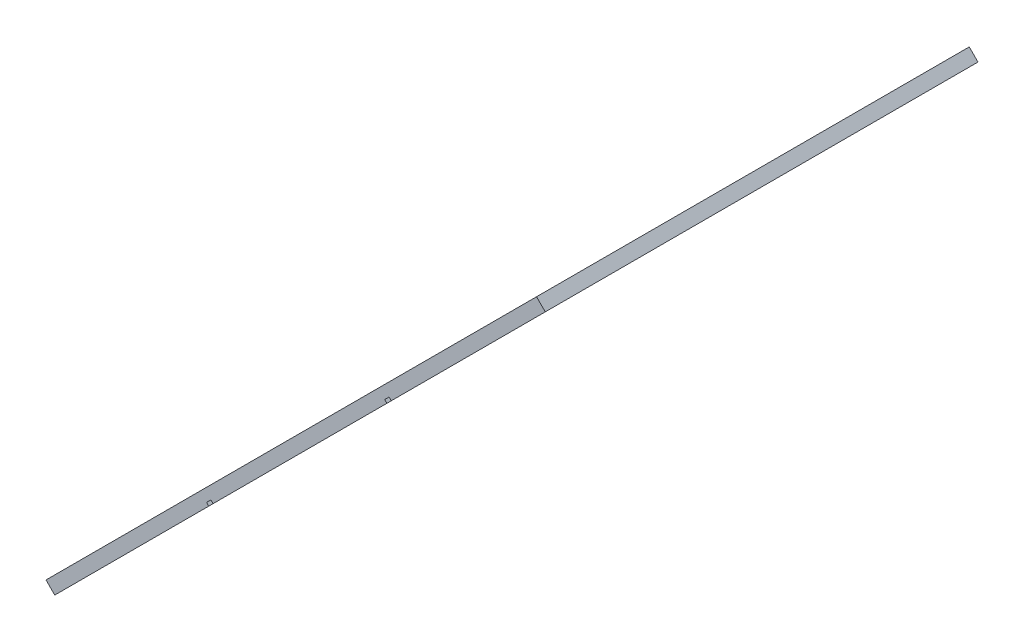
ISO-10303-21;
HEADER;
FILE_DESCRIPTION(('STEP AP214'),'2;1');
FILE_NAME('part.step','',(''),(''),'','','');
FILE_SCHEMA(('AUTOMOTIVE_DESIGN { 1 0 10303 214 1 1 1 1 }'));
ENDSEC;
DATA;
#1=APPLICATION_CONTEXT('core data for automotive mechanical design processes');
#2=APPLICATION_PROTOCOL_DEFINITION('international standard','automotive_design',2000,#1);
#3=PRODUCT_CONTEXT('',#1,'mechanical');
#4=PRODUCT('Part','Part','',(#3));
#5=PRODUCT_RELATED_PRODUCT_CATEGORY('part','',(#4));
#6=PRODUCT_DEFINITION_FORMATION('','',#4);
#7=PRODUCT_DEFINITION_CONTEXT('part definition',#1,'design');
#8=PRODUCT_DEFINITION('design','',#6,#7);
#9=PRODUCT_DEFINITION_SHAPE('','',#8);
#10=(LENGTH_UNIT() NAMED_UNIT(*) SI_UNIT(.MILLI.,.METRE.));
#11=(NAMED_UNIT(*) PLANE_ANGLE_UNIT() SI_UNIT($,.RADIAN.));
#12=(NAMED_UNIT(*) SI_UNIT($,.STERADIAN.) SOLID_ANGLE_UNIT());
#13=UNCERTAINTY_MEASURE_WITH_UNIT(LENGTH_MEASURE(1.E-05),#10,'distance_accuracy_value','');
#14=(GEOMETRIC_REPRESENTATION_CONTEXT(3) GLOBAL_UNCERTAINTY_ASSIGNED_CONTEXT((#13)) GLOBAL_UNIT_ASSIGNED_CONTEXT((#10,
#11,#12)) REPRESENTATION_CONTEXT('',''));
#15=CARTESIAN_POINT('',(0.,0.,0.));
#16=DIRECTION('',(0.,0.,1.));
#17=DIRECTION('',(1.,0.,0.));
#18=AXIS2_PLACEMENT_3D('',#15,#16,#17);
#19=CARTESIAN_POINT('',(-184.319805153395,151.035533905932,50.));
#20=DIRECTION('',(0.707106781186549,-0.707106781186546,0.));
#21=DIRECTION('',(0.707106781186546,0.707106781186549,0.));
#22=AXIS2_PLACEMENT_3D('',#19,#20,#21);
#23=PLANE('',#22);
#24=DIRECTION('',(0.,0.,1.));
#25=VECTOR('',#24,1.);
#26=CARTESIAN_POINT('',(-155.415506253417,179.93983280591,49.9999999999997));
#27=LINE('',#26,#25);
#28=CARTESIAN_POINT('',(-155.415506253417,179.93983280591,49.9999999999997));
#29=VERTEX_POINT('',#28);
#30=CARTESIAN_POINT('',(-155.415506253417,179.93983280591,120.));
#31=VERTEX_POINT('',#30);
#32=EDGE_CURVE('E241',#29,#31,#27,.T.);
#33=ORIENTED_EDGE('',*,*,#32,.F.);
#34=DIRECTION('',(0.707106781186546,0.707106781186549,0.));
#35=VECTOR('',#34,1.);
#36=CARTESIAN_POINT('',(-184.319805153395,151.035533905932,50.));
#37=LINE('',#36,#35);
#38=CARTESIAN_POINT('',(-130.502585382088,204.852753677239,50.));
#39=VERTEX_POINT('',#38);
#40=EDGE_CURVE('E361',#29,#39,#37,.T.);
#41=ORIENTED_EDGE('',*,*,#40,.T.);
#42=DIRECTION('',(0.,0.,-1.));
#43=VECTOR('',#42,1.);
#44=CARTESIAN_POINT('',(-130.502585382088,204.852753677239,50.));
#45=LINE('',#44,#43);
#46=CARTESIAN_POINT('',(-130.502585382088,204.852753677239,120.));
#47=VERTEX_POINT('',#46);
#48=EDGE_CURVE('E278',#39,#47,#45,.F.);
#49=ORIENTED_EDGE('',*,*,#48,.T.);
#50=DIRECTION('',(0.707106781186546,0.707106781186549,0.));
#51=VECTOR('',#50,1.);
#52=CARTESIAN_POINT('',(-184.319805153395,151.035533905932,120.));
#53=LINE('',#52,#51);
#54=EDGE_CURVE('E365',#31,#47,#53,.T.);
#55=ORIENTED_EDGE('',*,*,#54,.F.);
#56=EDGE_LOOP('',(#33,#41,#49,#55));
#57=FACE_BOUND('',#56,.T.);
#58=ADVANCED_FACE('F41',(#57),#23,.T.);
#59=DIRECTION('',(0.,0.,-1.));
#60=VECTOR('',#59,1.);
#61=CARTESIAN_POINT('',(-156.122613034604,179.232726024723,49.9999999999997));
#62=LINE('',#61,#60);
#63=CARTESIAN_POINT('',(-156.122613034604,179.232726024724,120.));
#64=VERTEX_POINT('',#63);
#65=CARTESIAN_POINT('',(-156.122613034604,179.232726024723,49.9999999999997));
#66=VERTEX_POINT('',#65);
#67=EDGE_CURVE('E271',#64,#66,#62,.T.);
#68=ORIENTED_EDGE('',*,*,#67,.F.);
#69=CARTESIAN_POINT('',(-184.232726024724,151.122613034603,120.));
#70=VERTEX_POINT('',#69);
#71=EDGE_CURVE('E247',#70,#64,#53,.T.);
#72=ORIENTED_EDGE('',*,*,#71,.F.);
#73=DIRECTION('',(0.,0.,1.));
#74=VECTOR('',#73,1.);
#75=CARTESIAN_POINT('',(-184.232726024724,151.122613034603,50.0000000000001));
#76=LINE('',#75,#74);
#77=CARTESIAN_POINT('',(-184.232726024724,151.122613034603,50.0000000000001));
#78=VERTEX_POINT('',#77);
#79=EDGE_CURVE('E258',#78,#70,#76,.T.);
#80=ORIENTED_EDGE('',*,*,#79,.F.);
#81=EDGE_CURVE('E360',#78,#66,#37,.T.);
#82=ORIENTED_EDGE('',*,*,#81,.T.);
#83=EDGE_LOOP('',(#68,#72,#80,#82));
#84=FACE_BOUND('',#83,.T.);
#85=CARTESIAN_POINT('',(-175.186205619217,160.16913344011,104.298625785396));
#86=DIRECTION('',(-0.707106781186549,0.707106781186546,0.));
#87=DIRECTION('',(-0.707106781186546,-0.707106781186549,0.));
#88=AXIS2_PLACEMENT_3D('',#85,#86,#87);
#89=CIRCLE('',#88,3.);
#90=CARTESIAN_POINT('',(-173.123673896905,162.231665162423,103.597251570793));
#91=VERTEX_POINT('',#90);
#92=CARTESIAN_POINT('',(-173.372296946362,161.983042112965,105.85409055616));
#93=VERTEX_POINT('',#92);
#94=EDGE_CURVE('E295',#91,#93,#89,.F.);
#95=ORIENTED_EDGE('',*,*,#94,.F.);
#96=CARTESIAN_POINT('',(-177.248737341529,158.106601717798,105.));
#97=DIRECTION('',(-0.707106781186549,0.707106781186546,0.));
#98=DIRECTION('',(-0.707106781186546,-0.707106781186549,0.));
#99=AXIS2_PLACEMENT_3D('',#96,#97,#98);
#100=CIRCLE('',#99,6.00000000000001);
#101=CARTESIAN_POINT('',(-181.00151777502,154.353821284307,102.201200608114));
#102=VERTEX_POINT('',#101);
#103=EDGE_CURVE('E369',#91,#102,#100,.T.);
#104=ORIENTED_EDGE('',*,*,#103,.T.);
#105=CARTESIAN_POINT('',(-179.125127558275,156.230211501053,103.600600304057));
#106=DIRECTION('',(-0.707106781186549,0.707106781186546,0.));
#107=DIRECTION('',(-0.707106781186546,-0.707106781186549,0.));
#108=AXIS2_PLACEMENT_3D('',#105,#106,#107);
#109=CIRCLE('',#108,3.);
#110=CARTESIAN_POINT('',(-181.245777931757,154.10956112757,103.525208083656));
#111=VERTEX_POINT('',#110);
#112=EDGE_CURVE('E373',#102,#111,#109,.T.);
#113=ORIENTED_EDGE('',*,*,#112,.T.);
#114=DIRECTION('',(-0.0177701167648365,-0.0177701167648367,0.999684173076841));
#115=VECTOR('',#114,1.);
#116=CARTESIAN_POINT('',(-179.39813491411,155.957204145217,-0.416679675499514));
#117=LINE('',#116,#115);
#118=CARTESIAN_POINT('',(-181.378046154952,153.977292904375,110.966152399246));
#119=VERTEX_POINT('',#118);
#120=EDGE_CURVE('E376',#111,#119,#117,.T.);
#121=ORIENTED_EDGE('',*,*,#120,.T.);
#122=CARTESIAN_POINT('',(-179.257395781469,156.097943277858,111.041544619647));
#123=DIRECTION('',(-0.707106781186549,0.707106781186546,0.));
#124=DIRECTION('',(-0.707106781186546,-0.707106781186549,0.));
#125=AXIS2_PLACEMENT_3D('',#122,#123,#124);
#126=CIRCLE('',#125,3.00000000000001);
#127=CARTESIAN_POINT('',(-181.04073041417,154.314608645157,112.666178478589));
#128=VERTEX_POINT('',#127);
#129=EDGE_CURVE('E379',#128,#119,#126,.F.);
#130=ORIENTED_EDGE('',*,*,#129,.F.);
#131=CARTESIAN_POINT('',(-178.662950903902,156.692388155425,110.5));
#132=DIRECTION('',(-0.707106781186549,0.707106781186546,0.));
#133=DIRECTION('',(-0.707106781186546,-0.707106781186549,0.));
#134=AXIS2_PLACEMENT_3D('',#131,#132,#133);
#135=CIRCLE('',#134,4.00000000000001);
#136=CARTESIAN_POINT('',(-176.488019763067,158.86731929626,113.057215099527));
#137=VERTEX_POINT('',#136);
#138=EDGE_CURVE('E382',#137,#128,#135,.F.);
#139=ORIENTED_EDGE('',*,*,#138,.F.);
#140=CARTESIAN_POINT('',(-178.119218118694,157.236120940634,111.139303774882));
#141=DIRECTION('',(-0.707106781186549,0.707106781186546,0.));
#142=DIRECTION('',(-0.707106781186546,-0.707106781186549,0.));
#143=AXIS2_PLACEMENT_3D('',#140,#141,#142);
#144=CIRCLE('',#143,2.99999999999999);
#145=CARTESIAN_POINT('',(-176.305309445839,159.050029613488,112.694768545645));
#146=VERTEX_POINT('',#145);
#147=EDGE_CURVE('E385',#137,#146,#144,.T.);
#148=ORIENTED_EDGE('',*,*,#147,.T.);
#149=DIRECTION('',(-0.366626562434572,-0.366626562434574,0.855084748685659));
#150=VECTOR('',#149,1.);
#151=CARTESIAN_POINT('',(-138.656493093717,196.698845965611,24.8862681058764));
#152=LINE('',#151,#150);
#153=EDGE_CURVE('E368',#93,#146,#152,.T.);
#154=ORIENTED_EDGE('',*,*,#153,.F.);
#155=EDGE_LOOP('',(#95,#104,#113,#121,#130,#139,#148,#154));
#156=FACE_BOUND('',#155,.T.);
#157=CARTESIAN_POINT('',(-161.230211501053,174.125127558274,103.600600304057));
#158=DIRECTION('',(-0.707106781186549,0.707106781186546,0.));
#159=DIRECTION('',(-0.707106781186546,-0.707106781186549,0.));
#160=AXIS2_PLACEMENT_3D('',#157,#158,#159);
#161=CIRCLE('',#160,3.00000000000001);
#162=CARTESIAN_POINT('',(-159.353821284308,176.00151777502,102.201200608114));
#163=VERTEX_POINT('',#162);
#164=CARTESIAN_POINT('',(-159.10956112757,176.245777931757,103.525208083656));
#165=VERTEX_POINT('',#164);
#166=EDGE_CURVE('E372',#163,#165,#161,.F.);
#167=ORIENTED_EDGE('',*,*,#166,.F.);
#168=CARTESIAN_POINT('',(-163.106601717798,172.248737341529,105.));
#169=DIRECTION('',(-0.707106781186549,0.707106781186546,0.));
#170=DIRECTION('',(-0.707106781186546,-0.707106781186549,0.));
#171=AXIS2_PLACEMENT_3D('',#168,#169,#170);
#172=CIRCLE('',#171,6.00000000000001);
#173=CARTESIAN_POINT('',(-167.231665162423,168.123673896904,103.597251570793));
#174=VERTEX_POINT('',#173);
#175=EDGE_CURVE('E393',#174,#163,#172,.F.);
#176=ORIENTED_EDGE('',*,*,#175,.F.);
#177=CARTESIAN_POINT('',(-165.169133440111,170.186205619217,104.298625785396));
#178=DIRECTION('',(-0.707106781186549,0.707106781186546,0.));
#179=DIRECTION('',(-0.707106781186546,-0.707106781186549,0.));
#180=AXIS2_PLACEMENT_3D('',#177,#178,#179);
#181=CIRCLE('',#180,3.);
#182=CARTESIAN_POINT('',(-166.983042112965,168.372296946362,105.85409055616));
#183=VERTEX_POINT('',#182);
#184=EDGE_CURVE('E396',#174,#183,#181,.T.);
#185=ORIENTED_EDGE('',*,*,#184,.T.);
#186=DIRECTION('',(0.366626562434572,0.366626562434574,0.855084748685659));
#187=VECTOR('',#186,1.);
#188=CARTESIAN_POINT('',(-200.354695602785,135.000643456542,28.0212359258847));
#189=LINE('',#188,#187);
#190=CARTESIAN_POINT('',(-164.050029613489,171.305309445839,112.694768545645));
#191=VERTEX_POINT('',#190);
#192=EDGE_CURVE('E399',#183,#191,#189,.T.);
#193=ORIENTED_EDGE('',*,*,#192,.T.);
#194=CARTESIAN_POINT('',(-162.236120940634,173.119218118693,111.139303774882));
#195=DIRECTION('',(-0.707106781186549,0.707106781186546,0.));
#196=DIRECTION('',(-0.707106781186546,-0.707106781186549,0.));
#197=AXIS2_PLACEMENT_3D('',#194,#195,#196);
#198=CIRCLE('',#197,2.99999999999998);
#199=CARTESIAN_POINT('',(-163.867319296261,171.488019763067,113.057215099527));
#200=VERTEX_POINT('',#199);
#201=EDGE_CURVE('E402',#200,#191,#198,.F.);
#202=ORIENTED_EDGE('',*,*,#201,.F.);
#203=CARTESIAN_POINT('',(-161.692388155425,173.662950903902,110.5));
#204=DIRECTION('',(-0.707106781186549,0.707106781186546,0.));
#205=DIRECTION('',(-0.707106781186546,-0.707106781186549,0.));
#206=AXIS2_PLACEMENT_3D('',#203,#204,#205);
#207=CIRCLE('',#206,3.99999999999999);
#208=CARTESIAN_POINT('',(-159.314608645158,176.04073041417,112.666178478589));
#209=VERTEX_POINT('',#208);
#210=EDGE_CURVE('E405',#200,#209,#207,.T.);
#211=ORIENTED_EDGE('',*,*,#210,.T.);
#212=CARTESIAN_POINT('',(-161.097943277858,174.257395781469,111.041544619647));
#213=DIRECTION('',(-0.707106781186549,0.707106781186546,0.));
#214=DIRECTION('',(-0.707106781186546,-0.707106781186549,0.));
#215=AXIS2_PLACEMENT_3D('',#212,#213,#214);
#216=CIRCLE('',#215,3.);
#217=CARTESIAN_POINT('',(-158.977292904376,176.378046154951,110.966152399246));
#218=VERTEX_POINT('',#217);
#219=EDGE_CURVE('E408',#209,#218,#216,.T.);
#220=ORIENTED_EDGE('',*,*,#219,.T.);
#221=DIRECTION('',(0.0177701167648386,0.0177701167648386,0.999684173076841));
#222=VECTOR('',#221,1.);
#223=CARTESIAN_POINT('',(-160.954046374719,174.401292684608,-0.2390346306642));
#224=LINE('',#223,#222);
#225=EDGE_CURVE('E392',#165,#218,#224,.T.);
#226=ORIENTED_EDGE('',*,*,#225,.F.);
#227=EDGE_LOOP('',(#167,#176,#185,#193,#202,#211,#220,#226));
#228=FACE_BOUND('',#227,.T.);
#229=ADVANCED_FACE('F455',(#84,#156,#228),#23,.T.);
#230=CARTESIAN_POINT('',(-162.512156840231,175.671609343842,111.041544619647));
#231=DIRECTION('',(0.707106781186549,-0.707106781186546,0.));
#232=DIRECTION('',(0.707106781186546,0.707106781186549,0.));
#233=AXIS2_PLACEMENT_3D('',#230,#231,#232);
#234=CYLINDRICAL_SURFACE('',#233,3.);
#235=DIRECTION('',(-0.707106781186549,0.707106781186546,0.));
#236=VECTOR('',#235,1.);
#237=CARTESIAN_POINT('',(-160.391506466749,177.792259717325,110.966152399246));
#238=LINE('',#237,#236);
#239=CARTESIAN_POINT('',(-160.391506466749,177.792259717325,110.966152399246));
#240=VERTEX_POINT('',#239);
#241=EDGE_CURVE('E12',#218,#240,#238,.T.);
#242=ORIENTED_EDGE('',*,*,#241,.F.);
#243=ORIENTED_EDGE('',*,*,#219,.F.);
#244=DIRECTION('',(-0.707106781186549,0.707106781186546,0.));
#245=VECTOR('',#244,1.);
#246=CARTESIAN_POINT('',(-160.728822207531,177.454943976543,112.666178478589));
#247=LINE('',#246,#245);
#248=CARTESIAN_POINT('',(-160.728822207531,177.454943976543,112.666178478589));
#249=VERTEX_POINT('',#248);
#250=EDGE_CURVE('E50',#209,#249,#247,.T.);
#251=ORIENTED_EDGE('',*,*,#250,.T.);
#252=CARTESIAN_POINT('',(-162.512156840231,175.671609343842,111.041544619647));
#253=DIRECTION('',(-0.707106781186549,0.707106781186546,0.));
#254=DIRECTION('',(-0.707106781186546,-0.707106781186549,0.));
#255=AXIS2_PLACEMENT_3D('',#252,#253,#254);
#256=CIRCLE('',#255,3.);
#257=EDGE_CURVE('E335',#249,#240,#256,.T.);
#258=ORIENTED_EDGE('',*,*,#257,.T.);
#259=EDGE_LOOP('',(#242,#243,#251,#258));
#260=FACE_BOUND('',#259,.T.);
#261=ADVANCED_FACE('F441',(#260),#234,.F.);
#262=CARTESIAN_POINT('',(-163.106601717798,175.077164466275,110.5));
#263=DIRECTION('',(0.707106781186549,-0.707106781186546,0.));
#264=DIRECTION('',(0.707106781186546,0.707106781186549,0.));
#265=AXIS2_PLACEMENT_3D('',#262,#263,#264);
#266=CYLINDRICAL_SURFACE('',#265,3.99999999999999);
#267=ORIENTED_EDGE('',*,*,#250,.F.);
#268=ORIENTED_EDGE('',*,*,#210,.F.);
#269=DIRECTION('',(-0.707106781186549,0.707106781186546,0.));
#270=VECTOR('',#269,1.);
#271=CARTESIAN_POINT('',(-165.281532858634,172.90223332544,113.057215099527));
#272=LINE('',#271,#270);
#273=CARTESIAN_POINT('',(-165.281532858634,172.90223332544,113.057215099527));
#274=VERTEX_POINT('',#273);
#275=EDGE_CURVE('E436',#200,#274,#272,.T.);
#276=ORIENTED_EDGE('',*,*,#275,.T.);
#277=CARTESIAN_POINT('',(-163.106601717798,175.077164466275,110.5));
#278=DIRECTION('',(-0.707106781186549,0.707106781186546,0.));
#279=DIRECTION('',(-0.707106781186546,-0.707106781186549,0.));
#280=AXIS2_PLACEMENT_3D('',#277,#278,#279);
#281=CIRCLE('',#280,3.99999999999999);
#282=EDGE_CURVE('E338',#274,#249,#281,.T.);
#283=ORIENTED_EDGE('',*,*,#282,.T.);
#284=EDGE_LOOP('',(#267,#268,#276,#283));
#285=FACE_BOUND('',#284,.T.);
#286=ADVANCED_FACE('F449',(#285),#266,.F.);
#287=CARTESIAN_POINT('',(-163.650334503007,174.533431681066,111.139303774882));
#288=DIRECTION('',(0.707106781186549,-0.707106781186546,0.));
#289=DIRECTION('',(0.707106781186546,0.707106781186549,0.));
#290=AXIS2_PLACEMENT_3D('',#287,#288,#289);
#291=CYLINDRICAL_SURFACE('',#290,2.99999999999998);
#292=ORIENTED_EDGE('',*,*,#275,.F.);
#293=ORIENTED_EDGE('',*,*,#201,.T.);
#294=DIRECTION('',(-0.707106781186549,0.707106781186546,0.));
#295=VECTOR('',#294,1.);
#296=CARTESIAN_POINT('',(-165.464243175862,172.719523008212,112.694768545645));
#297=LINE('',#296,#295);
#298=CARTESIAN_POINT('',(-165.464243175862,172.719523008212,112.694768545645));
#299=VERTEX_POINT('',#298);
#300=EDGE_CURVE('E434',#191,#299,#297,.T.);
#301=ORIENTED_EDGE('',*,*,#300,.T.);
#302=CARTESIAN_POINT('',(-163.650334503007,174.533431681066,111.139303774882));
#303=DIRECTION('',(-0.707106781186549,0.707106781186546,0.));
#304=DIRECTION('',(-0.707106781186546,-0.707106781186549,0.));
#305=AXIS2_PLACEMENT_3D('',#302,#303,#304);
#306=CIRCLE('',#305,2.99999999999998);
#307=EDGE_CURVE('E341',#274,#299,#306,.F.);
#308=ORIENTED_EDGE('',*,*,#307,.F.);
#309=EDGE_LOOP('',(#292,#293,#301,#308));
#310=FACE_BOUND('',#309,.T.);
#311=ADVANCED_FACE('F452',(#310),#291,.F.);
#312=CARTESIAN_POINT('',(-201.768909165158,136.414857018915,28.0212359258847));
#313=DIRECTION('',(0.604636224284823,0.604636224284825,-0.518488256921199));
#314=DIRECTION('',(0.366626562434572,0.366626562434574,0.855084748685659));
#315=AXIS2_PLACEMENT_3D('',#312,#313,#314);
#316=PLANE('',#315);
#317=ORIENTED_EDGE('',*,*,#300,.F.);
#318=ORIENTED_EDGE('',*,*,#192,.F.);
#319=DIRECTION('',(-0.707106781186549,0.707106781186546,0.));
#320=VECTOR('',#319,1.);
#321=CARTESIAN_POINT('',(-168.397255675338,169.786510508735,105.85409055616));
#322=LINE('',#321,#320);
#323=CARTESIAN_POINT('',(-168.397255675338,169.786510508735,105.85409055616));
#324=VERTEX_POINT('',#323);
#325=EDGE_CURVE('E432',#183,#324,#322,.T.);
#326=ORIENTED_EDGE('',*,*,#325,.T.);
#327=DIRECTION('',(0.366626562434572,0.366626562434574,0.855084748685659));
#328=VECTOR('',#327,1.);
#329=CARTESIAN_POINT('',(-201.768909165158,136.414857018915,28.0212359258847));
#330=LINE('',#329,#328);
#331=EDGE_CURVE('E344',#324,#299,#330,.T.);
#332=ORIENTED_EDGE('',*,*,#331,.T.);
#333=EDGE_LOOP('',(#317,#318,#326,#332));
#334=FACE_BOUND('',#333,.T.);
#335=ADVANCED_FACE('F460',(#334),#316,.T.);
#336=CARTESIAN_POINT('',(-166.583347002484,171.60041918159,104.298625785396));
#337=DIRECTION('',(0.707106781186549,-0.707106781186546,0.));
#338=DIRECTION('',(0.707106781186546,0.707106781186549,0.));
#339=AXIS2_PLACEMENT_3D('',#336,#337,#338);
#340=CYLINDRICAL_SURFACE('',#339,3.);
#341=ORIENTED_EDGE('',*,*,#325,.F.);
#342=ORIENTED_EDGE('',*,*,#184,.F.);
#343=DIRECTION('',(-0.707106781186549,0.707106781186546,0.));
#344=VECTOR('',#343,1.);
#345=CARTESIAN_POINT('',(-168.645878724796,169.537887459277,103.597251570793));
#346=LINE('',#345,#344);
#347=CARTESIAN_POINT('',(-168.645878724796,169.537887459277,103.597251570793));
#348=VERTEX_POINT('',#347);
#349=EDGE_CURVE('E430',#174,#348,#346,.T.);
#350=ORIENTED_EDGE('',*,*,#349,.T.);
#351=CARTESIAN_POINT('',(-166.583347002484,171.60041918159,104.298625785396));
#352=DIRECTION('',(-0.707106781186549,0.707106781186546,0.));
#353=DIRECTION('',(-0.707106781186546,-0.707106781186549,0.));
#354=AXIS2_PLACEMENT_3D('',#351,#352,#353);
#355=CIRCLE('',#354,3.);
#356=EDGE_CURVE('E347',#348,#324,#355,.T.);
#357=ORIENTED_EDGE('',*,*,#356,.T.);
#358=EDGE_LOOP('',(#341,#342,#350,#357));
#359=FACE_BOUND('',#358,.T.);
#360=ADVANCED_FACE('F465',(#359),#340,.F.);
#361=CARTESIAN_POINT('',(-164.520815280171,173.662950903902,105.));
#362=DIRECTION('',(0.707106781186549,-0.707106781186546,0.));
#363=DIRECTION('',(0.707106781186546,0.707106781186549,0.));
#364=AXIS2_PLACEMENT_3D('',#361,#362,#363);
#365=CYLINDRICAL_SURFACE('',#364,6.00000000000001);
#366=ORIENTED_EDGE('',*,*,#349,.F.);
#367=ORIENTED_EDGE('',*,*,#175,.T.);
#368=DIRECTION('',(-0.707106781186549,0.707106781186546,0.));
#369=VECTOR('',#368,1.);
#370=CARTESIAN_POINT('',(-160.768034846681,177.415731337393,102.201200608114));
#371=LINE('',#370,#369);
#372=CARTESIAN_POINT('',(-160.768034846681,177.415731337393,102.201200608114));
#373=VERTEX_POINT('',#372);
#374=EDGE_CURVE('E428',#163,#373,#371,.T.);
#375=ORIENTED_EDGE('',*,*,#374,.T.);
#376=CARTESIAN_POINT('',(-164.520815280171,173.662950903902,105.));
#377=DIRECTION('',(-0.707106781186549,0.707106781186546,0.));
#378=DIRECTION('',(-0.707106781186546,-0.707106781186549,0.));
#379=AXIS2_PLACEMENT_3D('',#376,#377,#378);
#380=CIRCLE('',#379,6.00000000000001);
#381=EDGE_CURVE('E350',#348,#373,#380,.F.);
#382=ORIENTED_EDGE('',*,*,#381,.F.);
#383=EDGE_LOOP('',(#366,#367,#375,#382));
#384=FACE_BOUND('',#383,.T.);
#385=ADVANCED_FACE('F467',(#384),#365,.F.);
#386=CARTESIAN_POINT('',(-162.644425063426,175.539341120647,103.600600304057));
#387=DIRECTION('',(0.707106781186549,-0.707106781186546,0.));
#388=DIRECTION('',(0.707106781186546,0.707106781186549,0.));
#389=AXIS2_PLACEMENT_3D('',#386,#387,#388);
#390=CYLINDRICAL_SURFACE('',#389,3.00000000000001);
#391=ORIENTED_EDGE('',*,*,#374,.F.);
#392=ORIENTED_EDGE('',*,*,#166,.T.);
#393=DIRECTION('',(-0.707106781186549,0.707106781186546,0.));
#394=VECTOR('',#393,1.);
#395=CARTESIAN_POINT('',(-160.523774689944,177.65999149413,103.525208083656));
#396=LINE('',#395,#394);
#397=CARTESIAN_POINT('',(-160.523774689944,177.65999149413,103.525208083656));
#398=VERTEX_POINT('',#397);
#399=EDGE_CURVE('E45',#165,#398,#396,.T.);
#400=ORIENTED_EDGE('',*,*,#399,.T.);
#401=CARTESIAN_POINT('',(-162.644425063426,175.539341120647,103.600600304057));
#402=DIRECTION('',(-0.707106781186549,0.707106781186546,0.));
#403=DIRECTION('',(-0.707106781186546,-0.707106781186549,0.));
#404=AXIS2_PLACEMENT_3D('',#401,#402,#403);
#405=CIRCLE('',#404,3.00000000000001);
#406=EDGE_CURVE('E329',#373,#398,#405,.F.);
#407=ORIENTED_EDGE('',*,*,#406,.F.);
#408=EDGE_LOOP('',(#391,#392,#400,#407));
#409=FACE_BOUND('',#408,.T.);
#410=ADVANCED_FACE('F473',(#409),#390,.F.);
#411=CARTESIAN_POINT('',(-179.533431681067,158.650334503007,111.139303774882));
#412=DIRECTION('',(0.707106781186549,-0.707106781186546,0.));
#413=DIRECTION('',(0.707106781186546,0.707106781186549,0.));
#414=AXIS2_PLACEMENT_3D('',#411,#412,#413);
#415=CYLINDRICAL_SURFACE('',#414,2.99999999999999);
#416=DIRECTION('',(-0.707106781186549,0.707106781186546,0.));
#417=VECTOR('',#416,1.);
#418=CARTESIAN_POINT('',(-177.719523008212,160.464243175861,112.694768545645));
#419=LINE('',#418,#417);
#420=CARTESIAN_POINT('',(-177.719523008212,160.464243175861,112.694768545645));
#421=VERTEX_POINT('',#420);
#422=EDGE_CURVE('E425',#146,#421,#419,.T.);
#423=ORIENTED_EDGE('',*,*,#422,.F.);
#424=ORIENTED_EDGE('',*,*,#147,.F.);
#425=DIRECTION('',(-0.707106781186549,0.707106781186546,0.));
#426=VECTOR('',#425,1.);
#427=CARTESIAN_POINT('',(-177.90223332544,160.281532858633,113.057215099527));
#428=LINE('',#427,#426);
#429=CARTESIAN_POINT('',(-177.90223332544,160.281532858633,113.057215099527));
#430=VERTEX_POINT('',#429);
#431=EDGE_CURVE('E423',#137,#430,#428,.T.);
#432=ORIENTED_EDGE('',*,*,#431,.T.);
#433=CARTESIAN_POINT('',(-179.533431681067,158.650334503007,111.139303774882));
#434=DIRECTION('',(-0.707106781186549,0.707106781186546,0.));
#435=DIRECTION('',(-0.707106781186546,-0.707106781186549,0.));
#436=AXIS2_PLACEMENT_3D('',#433,#434,#435);
#437=CIRCLE('',#436,2.99999999999999);
#438=EDGE_CURVE('E311',#430,#421,#437,.T.);
#439=ORIENTED_EDGE('',*,*,#438,.T.);
#440=EDGE_LOOP('',(#423,#424,#432,#439));
#441=FACE_BOUND('',#440,.T.);
#442=ADVANCED_FACE('F475',(#441),#415,.F.);
#443=CARTESIAN_POINT('',(-180.077164466275,158.106601717798,110.5));
#444=DIRECTION('',(0.707106781186549,-0.707106781186546,0.));
#445=DIRECTION('',(0.707106781186546,0.707106781186549,0.));
#446=AXIS2_PLACEMENT_3D('',#443,#444,#445);
#447=CYLINDRICAL_SURFACE('',#446,4.00000000000001);
#448=ORIENTED_EDGE('',*,*,#431,.F.);
#449=ORIENTED_EDGE('',*,*,#138,.T.);
#450=DIRECTION('',(-0.707106781186549,0.707106781186546,0.));
#451=VECTOR('',#450,1.);
#452=CARTESIAN_POINT('',(-182.454943976543,155.72882220753,112.666178478589));
#453=LINE('',#452,#451);
#454=CARTESIAN_POINT('',(-182.454943976543,155.72882220753,112.666178478589));
#455=VERTEX_POINT('',#454);
#456=EDGE_CURVE('E421',#128,#455,#453,.T.);
#457=ORIENTED_EDGE('',*,*,#456,.T.);
#458=CARTESIAN_POINT('',(-180.077164466275,158.106601717798,110.5));
#459=DIRECTION('',(-0.707106781186549,0.707106781186546,0.));
#460=DIRECTION('',(-0.707106781186546,-0.707106781186549,0.));
#461=AXIS2_PLACEMENT_3D('',#458,#459,#460);
#462=CIRCLE('',#461,4.00000000000001);
#463=EDGE_CURVE('E314',#430,#455,#462,.F.);
#464=ORIENTED_EDGE('',*,*,#463,.F.);
#465=EDGE_LOOP('',(#448,#449,#457,#464));
#466=FACE_BOUND('',#465,.T.);
#467=ADVANCED_FACE('F481',(#466),#447,.F.);
#468=CARTESIAN_POINT('',(-180.671609343842,157.512156840231,111.041544619647));
#469=DIRECTION('',(0.707106781186549,-0.707106781186546,0.));
#470=DIRECTION('',(0.707106781186546,0.707106781186549,0.));
#471=AXIS2_PLACEMENT_3D('',#468,#469,#470);
#472=CYLINDRICAL_SURFACE('',#471,3.00000000000001);
#473=ORIENTED_EDGE('',*,*,#456,.F.);
#474=ORIENTED_EDGE('',*,*,#129,.T.);
#475=DIRECTION('',(-0.707106781186549,0.707106781186546,0.));
#476=VECTOR('',#475,1.);
#477=CARTESIAN_POINT('',(-182.792259717325,155.391506466749,110.966152399246));
#478=LINE('',#477,#476);
#479=CARTESIAN_POINT('',(-182.792259717325,155.391506466749,110.966152399246));
#480=VERTEX_POINT('',#479);
#481=EDGE_CURVE('E419',#119,#480,#478,.T.);
#482=ORIENTED_EDGE('',*,*,#481,.T.);
#483=CARTESIAN_POINT('',(-180.671609343842,157.512156840231,111.041544619647));
#484=DIRECTION('',(-0.707106781186549,0.707106781186546,0.));
#485=DIRECTION('',(-0.707106781186546,-0.707106781186549,0.));
#486=AXIS2_PLACEMENT_3D('',#483,#484,#485);
#487=CIRCLE('',#486,3.00000000000001);
#488=EDGE_CURVE('E317',#455,#480,#487,.F.);
#489=ORIENTED_EDGE('',*,*,#488,.F.);
#490=EDGE_LOOP('',(#473,#474,#482,#489));
#491=FACE_BOUND('',#490,.T.);
#492=ADVANCED_FACE('F804',(#491),#472,.F.);
#493=CARTESIAN_POINT('',(-180.812348476483,157.37141770759,-0.416679675499514));
#494=DIRECTION('',(0.706883457827499,0.706883457827502,0.0251307401337854));
#495=DIRECTION('',(-0.0177701167648365,-0.0177701167648367,0.999684173076841));
#496=AXIS2_PLACEMENT_3D('',#493,#494,#495);
#497=PLANE('',#496);
#498=ORIENTED_EDGE('',*,*,#481,.F.);
#499=ORIENTED_EDGE('',*,*,#120,.F.);
#500=DIRECTION('',(-0.707106781186549,0.707106781186546,0.));
#501=VECTOR('',#500,1.);
#502=CARTESIAN_POINT('',(-182.65999149413,155.523774689943,103.525208083656));
#503=LINE('',#502,#501);
#504=CARTESIAN_POINT('',(-182.65999149413,155.523774689943,103.525208083656));
#505=VERTEX_POINT('',#504);
#506=EDGE_CURVE('E417',#111,#505,#503,.T.);
#507=ORIENTED_EDGE('',*,*,#506,.T.);
#508=DIRECTION('',(-0.0177701167648365,-0.0177701167648367,0.999684173076841));
#509=VECTOR('',#508,1.);
#510=CARTESIAN_POINT('',(-180.812348476483,157.37141770759,-0.416679675499514));
#511=LINE('',#510,#509);
#512=EDGE_CURVE('E320',#505,#480,#511,.T.);
#513=ORIENTED_EDGE('',*,*,#512,.T.);
#514=EDGE_LOOP('',(#498,#499,#507,#513));
#515=FACE_BOUND('',#514,.T.);
#516=ADVANCED_FACE('F814',(#515),#497,.T.);
#517=CARTESIAN_POINT('',(-180.539341120648,157.644425063426,103.600600304057));
#518=DIRECTION('',(0.707106781186549,-0.707106781186546,0.));
#519=DIRECTION('',(0.707106781186546,0.707106781186549,0.));
#520=AXIS2_PLACEMENT_3D('',#517,#518,#519);
#521=CYLINDRICAL_SURFACE('',#520,3.);
#522=ORIENTED_EDGE('',*,*,#506,.F.);
#523=ORIENTED_EDGE('',*,*,#112,.F.);
#524=DIRECTION('',(-0.707106781186549,0.707106781186546,0.));
#525=VECTOR('',#524,1.);
#526=CARTESIAN_POINT('',(-182.415731337393,155.76803484668,102.201200608114));
#527=LINE('',#526,#525);
#528=CARTESIAN_POINT('',(-182.415731337393,155.76803484668,102.201200608114));
#529=VERTEX_POINT('',#528);
#530=EDGE_CURVE('E415',#102,#529,#527,.T.);
#531=ORIENTED_EDGE('',*,*,#530,.T.);
#532=CARTESIAN_POINT('',(-180.539341120648,157.644425063426,103.600600304057));
#533=DIRECTION('',(-0.707106781186549,0.707106781186546,0.));
#534=DIRECTION('',(-0.707106781186546,-0.707106781186549,0.));
#535=AXIS2_PLACEMENT_3D('',#532,#533,#534);
#536=CIRCLE('',#535,3.);
#537=EDGE_CURVE('E323',#529,#505,#536,.T.);
#538=ORIENTED_EDGE('',*,*,#537,.T.);
#539=EDGE_LOOP('',(#522,#523,#531,#538));
#540=FACE_BOUND('',#539,.T.);
#541=ADVANCED_FACE('F824',(#540),#521,.F.);
#542=CARTESIAN_POINT('',(-178.662950903902,159.520815280171,105.));
#543=DIRECTION('',(0.707106781186549,-0.707106781186546,0.));
#544=DIRECTION('',(0.707106781186546,0.707106781186549,0.));
#545=AXIS2_PLACEMENT_3D('',#542,#543,#544);
#546=CYLINDRICAL_SURFACE('',#545,6.00000000000001);
#547=ORIENTED_EDGE('',*,*,#530,.F.);
#548=ORIENTED_EDGE('',*,*,#103,.F.);
#549=DIRECTION('',(-0.707106781186549,0.707106781186546,0.));
#550=VECTOR('',#549,1.);
#551=CARTESIAN_POINT('',(-174.537887459277,163.645878724796,103.597251570793));
#552=LINE('',#551,#550);
#553=CARTESIAN_POINT('',(-174.537887459277,163.645878724796,103.597251570793));
#554=VERTEX_POINT('',#553);
#555=EDGE_CURVE('E413',#91,#554,#552,.T.);
#556=ORIENTED_EDGE('',*,*,#555,.T.);
#557=CARTESIAN_POINT('',(-178.662950903902,159.520815280171,105.));
#558=DIRECTION('',(-0.707106781186549,0.707106781186546,0.));
#559=DIRECTION('',(-0.707106781186546,-0.707106781186549,0.));
#560=AXIS2_PLACEMENT_3D('',#557,#558,#559);
#561=CIRCLE('',#560,6.00000000000001);
#562=EDGE_CURVE('E326',#554,#529,#561,.T.);
#563=ORIENTED_EDGE('',*,*,#562,.T.);
#564=EDGE_LOOP('',(#547,#548,#556,#563));
#565=FACE_BOUND('',#564,.T.);
#566=ADVANCED_FACE('F834',(#565),#546,.F.);
#567=CARTESIAN_POINT('',(-176.60041918159,161.583347002483,104.298625785396));
#568=DIRECTION('',(0.707106781186549,-0.707106781186546,0.));
#569=DIRECTION('',(0.707106781186546,0.707106781186549,0.));
#570=AXIS2_PLACEMENT_3D('',#567,#568,#569);
#571=CYLINDRICAL_SURFACE('',#570,3.);
#572=ORIENTED_EDGE('',*,*,#555,.F.);
#573=ORIENTED_EDGE('',*,*,#94,.T.);
#574=DIRECTION('',(-0.707106781186549,0.707106781186546,0.));
#575=VECTOR('',#574,1.);
#576=CARTESIAN_POINT('',(-174.786510508736,163.397255675338,105.85409055616));
#577=LINE('',#576,#575);
#578=CARTESIAN_POINT('',(-174.786510508736,163.397255675338,105.85409055616));
#579=VERTEX_POINT('',#578);
#580=EDGE_CURVE('E357',#93,#579,#577,.T.);
#581=ORIENTED_EDGE('',*,*,#580,.T.);
#582=CARTESIAN_POINT('',(-176.60041918159,161.583347002483,104.298625785396));
#583=DIRECTION('',(-0.707106781186549,0.707106781186546,0.));
#584=DIRECTION('',(-0.707106781186546,-0.707106781186549,0.));
#585=AXIS2_PLACEMENT_3D('',#582,#583,#584);
#586=CIRCLE('',#585,3.);
#587=EDGE_CURVE('E304',#554,#579,#586,.F.);
#588=ORIENTED_EDGE('',*,*,#587,.F.);
#589=EDGE_LOOP('',(#572,#573,#581,#588));
#590=FACE_BOUND('',#589,.T.);
#591=ADVANCED_FACE('F581',(#590),#571,.F.);
#592=CARTESIAN_POINT('',(-185.734018715768,152.449747468306,50.));
#593=DIRECTION('',(0.,0.,-1.));
#594=DIRECTION('',(0.707106781186546,0.707106781186549,0.));
#595=AXIS2_PLACEMENT_3D('',#592,#593,#594);
#596=PLANE('',#595);
#597=DIRECTION('',(0.707106781186549,-0.707106781186546,0.));
#598=VECTOR('',#597,1.);
#599=CARTESIAN_POINT('',(-155.76905964401,180.293386196503,49.9999999999997));
#600=LINE('',#599,#598);
#601=CARTESIAN_POINT('',(-155.76905964401,180.293386196503,49.9999999999997));
#602=VERTEX_POINT('',#601);
#603=EDGE_CURVE('E249',#602,#29,#600,.T.);
#604=ORIENTED_EDGE('',*,*,#603,.F.);
#605=DIRECTION('',(0.707106781186534,0.707106781186561,0.));
#606=VECTOR('',#605,1.);
#607=CARTESIAN_POINT('',(-156.476166425197,179.586279415317,49.9999999999997));
#608=LINE('',#607,#606);
#609=CARTESIAN_POINT('',(-156.476166425197,179.586279415317,49.9999999999997));
#610=VERTEX_POINT('',#609);
#611=EDGE_CURVE('E231',#610,#602,#608,.T.);
#612=ORIENTED_EDGE('',*,*,#611,.F.);
#613=DIRECTION('',(0.707106781186549,-0.707106781186546,0.));
#614=VECTOR('',#613,1.);
#615=CARTESIAN_POINT('',(-156.476166425197,179.586279415317,49.9999999999997));
#616=LINE('',#615,#614);
#617=EDGE_CURVE('E228',#610,#66,#616,.T.);
#618=ORIENTED_EDGE('',*,*,#617,.T.);
#619=ORIENTED_EDGE('',*,*,#81,.F.);
#620=DIRECTION('',(0.707106781186549,-0.707106781186546,0.));
#621=VECTOR('',#620,1.);
#622=CARTESIAN_POINT('',(-184.586279415317,151.476166425197,50.0000000000001));
#623=LINE('',#622,#621);
#624=CARTESIAN_POINT('',(-184.586279415317,151.476166425197,50.0000000000001));
#625=VERTEX_POINT('',#624);
#626=EDGE_CURVE('E272',#625,#78,#623,.T.);
#627=ORIENTED_EDGE('',*,*,#626,.F.);
#628=DIRECTION('',(0.707106781186534,0.707106781186561,0.));
#629=VECTOR('',#628,1.);
#630=CARTESIAN_POINT('',(-184.586279415317,151.476166425197,50.0000000000001));
#631=LINE('',#630,#629);
#632=CARTESIAN_POINT('',(-185.293386196504,150.76905964401,50.0000000000001));
#633=VERTEX_POINT('',#632);
#634=EDGE_CURVE('E261',#633,#625,#631,.T.);
#635=ORIENTED_EDGE('',*,*,#634,.F.);
#636=DIRECTION('',(0.707106781186549,-0.707106781186546,0.));
#637=VECTOR('',#636,1.);
#638=CARTESIAN_POINT('',(-185.293386196504,150.76905964401,50.0000000000001));
#639=LINE('',#638,#637);
#640=CARTESIAN_POINT('',(-184.93983280591,150.415506253417,50.0000000000001));
#641=VERTEX_POINT('',#640);
#642=EDGE_CURVE('E274',#633,#641,#639,.T.);
#643=ORIENTED_EDGE('',*,*,#642,.T.);
#644=CARTESIAN_POINT('',(-209.852753677239,125.502585382088,50.));
#645=VERTEX_POINT('',#644);
#646=EDGE_CURVE('E308',#645,#641,#37,.T.);
#647=ORIENTED_EDGE('',*,*,#646,.F.);
#648=DIRECTION('',(-0.707106781186551,0.707106781186544,0.));
#649=VECTOR('',#648,1.);
#650=CARTESIAN_POINT('',(-211.266967239612,126.916798944461,50.));
#651=LINE('',#650,#649);
#652=CARTESIAN_POINT('',(-211.266967239612,126.916798944461,50.));
#653=VERTEX_POINT('',#652);
#654=EDGE_CURVE('E292',#645,#653,#651,.T.);
#655=ORIENTED_EDGE('',*,*,#654,.T.);
#656=DIRECTION('',(0.707106781186546,0.707106781186549,0.));
#657=VECTOR('',#656,1.);
#658=CARTESIAN_POINT('',(-185.734018715768,152.449747468306,50.));
#659=LINE('',#658,#657);
#660=CARTESIAN_POINT('',(-131.916798944461,206.266967239612,50.));
#661=VERTEX_POINT('',#660);
#662=EDGE_CURVE('E355',#653,#661,#659,.T.);
#663=ORIENTED_EDGE('',*,*,#662,.T.);
#664=DIRECTION('',(-0.707106781186548,0.707106781186547,0.));
#665=VECTOR('',#664,1.);
#666=CARTESIAN_POINT('',(-131.916798944461,206.266967239612,50.));
#667=LINE('',#666,#665);
#668=EDGE_CURVE('E288',#39,#661,#667,.T.);
#669=ORIENTED_EDGE('',*,*,#668,.F.);
#670=ORIENTED_EDGE('',*,*,#40,.F.);
#671=EDGE_LOOP('',(#604,#612,#618,#619,#627,#635,#643,#647,#655,#663,#669,#670));
#672=FACE_BOUND('',#671,.T.);
#673=ADVANCED_FACE('F516',(#672),#596,.T.);
#674=CARTESIAN_POINT('',(-140.07070665609,198.113059527984,24.8862681058764));
#675=DIRECTION('',(0.604636224284823,0.604636224284825,0.518488256921199));
#676=DIRECTION('',(-0.366626562434572,-0.366626562434574,0.855084748685659));
#677=AXIS2_PLACEMENT_3D('',#674,#675,#676);
#678=PLANE('',#677);
#679=ORIENTED_EDGE('',*,*,#153,.T.);
#680=ORIENTED_EDGE('',*,*,#422,.T.);
#681=DIRECTION('',(-0.366626562434572,-0.366626562434574,0.855084748685659));
#682=VECTOR('',#681,1.);
#683=CARTESIAN_POINT('',(-140.07070665609,198.113059527984,24.8862681058764));
#684=LINE('',#683,#682);
#685=EDGE_CURVE('E307',#579,#421,#684,.T.);
#686=ORIENTED_EDGE('',*,*,#685,.F.);
#687=ORIENTED_EDGE('',*,*,#580,.F.);
#688=EDGE_LOOP('',(#679,#680,#686,#687));
#689=FACE_BOUND('',#688,.T.);
#690=ADVANCED_FACE('F580',(#689),#678,.F.);
#691=CARTESIAN_POINT('',(-162.368259937093,175.815506246981,-0.2390346306642));
#692=DIRECTION('',(0.706883457827499,0.706883457827502,-0.0251307401337882));
#693=DIRECTION('',(0.0177701167648386,0.0177701167648386,0.999684173076841));
#694=AXIS2_PLACEMENT_3D('',#691,#692,#693);
#695=PLANE('',#694);
#696=ORIENTED_EDGE('',*,*,#225,.T.);
#697=ORIENTED_EDGE('',*,*,#241,.T.);
#698=DIRECTION('',(0.0177701167648386,0.0177701167648386,0.999684173076841));
#699=VECTOR('',#698,1.);
#700=CARTESIAN_POINT('',(-162.368259937093,175.815506246981,-0.2390346306642));
#701=LINE('',#700,#699);
#702=EDGE_CURVE('E332',#398,#240,#701,.T.);
#703=ORIENTED_EDGE('',*,*,#702,.F.);
#704=ORIENTED_EDGE('',*,*,#399,.F.);
#705=EDGE_LOOP('',(#696,#697,#703,#704));
#706=FACE_BOUND('',#705,.T.);
#707=ADVANCED_FACE('F471',(#706),#695,.F.);
#708=CARTESIAN_POINT('',(-185.734018715768,152.449747468306,120.));
#709=DIRECTION('',(0.,0.,-1.));
#710=DIRECTION('',(0.707106781186546,0.707106781186549,0.));
#711=AXIS2_PLACEMENT_3D('',#708,#709,#710);
#712=PLANE('',#711);
#713=DIRECTION('',(0.707106781186549,-0.707106781186546,0.));
#714=VECTOR('',#713,1.);
#715=CARTESIAN_POINT('',(-155.76905964401,180.293386196503,120.));
#716=LINE('',#715,#714);
#717=CARTESIAN_POINT('',(-155.76905964401,180.293386196503,120.));
#718=VERTEX_POINT('',#717);
#719=EDGE_CURVE('E291',#718,#31,#716,.T.);
#720=ORIENTED_EDGE('',*,*,#719,.T.);
#721=ORIENTED_EDGE('',*,*,#54,.T.);
#722=DIRECTION('',(-0.707106781186548,0.707106781186547,0.));
#723=VECTOR('',#722,1.);
#724=CARTESIAN_POINT('',(-131.916798944461,206.266967239612,120.));
#725=LINE('',#724,#723);
#726=CARTESIAN_POINT('',(-131.916798944461,206.266967239612,120.));
#727=VERTEX_POINT('',#726);
#728=EDGE_CURVE('E282',#47,#727,#725,.T.);
#729=ORIENTED_EDGE('',*,*,#728,.T.);
#730=DIRECTION('',(0.707106781186546,0.707106781186549,0.));
#731=VECTOR('',#730,1.);
#732=CARTESIAN_POINT('',(-185.734018715768,152.449747468306,120.));
#733=LINE('',#732,#731);
#734=CARTESIAN_POINT('',(-211.266967239612,126.916798944461,120.));
#735=VERTEX_POINT('',#734);
#736=EDGE_CURVE('E353',#735,#727,#733,.T.);
#737=ORIENTED_EDGE('',*,*,#736,.F.);
#738=DIRECTION('',(-0.707106781186551,0.707106781186544,0.));
#739=VECTOR('',#738,1.);
#740=CARTESIAN_POINT('',(-211.266967239612,126.916798944461,120.));
#741=LINE('',#740,#739);
#742=CARTESIAN_POINT('',(-209.852753677239,125.502585382088,120.));
#743=VERTEX_POINT('',#742);
#744=EDGE_CURVE('E299',#743,#735,#741,.T.);
#745=ORIENTED_EDGE('',*,*,#744,.F.);
#746=CARTESIAN_POINT('',(-184.93983280591,150.415506253417,120.));
#747=VERTEX_POINT('',#746);
#748=EDGE_CURVE('E362',#743,#747,#53,.T.);
#749=ORIENTED_EDGE('',*,*,#748,.T.);
#750=DIRECTION('',(0.707106781186549,-0.707106781186546,0.));
#751=VECTOR('',#750,1.);
#752=CARTESIAN_POINT('',(-185.293386196504,150.76905964401,120.));
#753=LINE('',#752,#751);
#754=CARTESIAN_POINT('',(-185.293386196504,150.76905964401,120.));
#755=VERTEX_POINT('',#754);
#756=EDGE_CURVE('E65',#755,#747,#753,.T.);
#757=ORIENTED_EDGE('',*,*,#756,.F.);
#758=DIRECTION('',(-0.707106781186561,-0.707106781186534,0.));
#759=VECTOR('',#758,1.);
#760=CARTESIAN_POINT('',(-184.586279415317,151.476166425197,120.));
#761=LINE('',#760,#759);
#762=CARTESIAN_POINT('',(-184.586279415317,151.476166425197,120.));
#763=VERTEX_POINT('',#762);
#764=EDGE_CURVE('E254',#763,#755,#761,.T.);
#765=ORIENTED_EDGE('',*,*,#764,.F.);
#766=DIRECTION('',(0.707106781186549,-0.707106781186546,0.));
#767=VECTOR('',#766,1.);
#768=CARTESIAN_POINT('',(-184.586279415317,151.476166425197,120.));
#769=LINE('',#768,#767);
#770=EDGE_CURVE('E269',#763,#70,#769,.T.);
#771=ORIENTED_EDGE('',*,*,#770,.T.);
#772=ORIENTED_EDGE('',*,*,#71,.T.);
#773=DIRECTION('',(0.707106781186549,-0.707106781186546,0.));
#774=VECTOR('',#773,1.);
#775=CARTESIAN_POINT('',(-156.476166425197,179.586279415317,120.));
#776=LINE('',#775,#774);
#777=CARTESIAN_POINT('',(-156.476166425197,179.586279415317,120.));
#778=VERTEX_POINT('',#777);
#779=EDGE_CURVE('E57',#778,#64,#776,.T.);
#780=ORIENTED_EDGE('',*,*,#779,.F.);
#781=DIRECTION('',(-0.707106781186547,-0.707106781186547,0.));
#782=VECTOR('',#781,1.);
#783=CARTESIAN_POINT('',(-156.476166425197,179.586279415317,120.));
#784=LINE('',#783,#782);
#785=EDGE_CURVE('E232',#718,#778,#784,.T.);
#786=ORIENTED_EDGE('',*,*,#785,.F.);
#787=EDGE_LOOP('',(#720,#721,#729,#737,#745,#749,#757,#765,#771,#772,#780,#786));
#788=FACE_BOUND('',#787,.T.);
#789=ADVANCED_FACE('F244',(#788),#712,.F.);
#790=CARTESIAN_POINT('',(-185.734018715768,152.449747468306,50.));
#791=DIRECTION('',(0.707106781186549,-0.707106781186546,0.));
#792=DIRECTION('',(0.707106781186546,0.707106781186549,0.));
#793=AXIS2_PLACEMENT_3D('',#790,#791,#792);
#794=PLANE('',#793);
#795=ORIENTED_EDGE('',*,*,#587,.T.);
#796=ORIENTED_EDGE('',*,*,#685,.T.);
#797=ORIENTED_EDGE('',*,*,#438,.F.);
#798=ORIENTED_EDGE('',*,*,#463,.T.);
#799=ORIENTED_EDGE('',*,*,#488,.T.);
#800=ORIENTED_EDGE('',*,*,#512,.F.);
#801=ORIENTED_EDGE('',*,*,#537,.F.);
#802=ORIENTED_EDGE('',*,*,#562,.F.);
#803=EDGE_LOOP('',(#795,#796,#797,#798,#799,#800,#801,#802));
#804=FACE_BOUND('',#803,.T.);
#805=ORIENTED_EDGE('',*,*,#406,.T.);
#806=ORIENTED_EDGE('',*,*,#702,.T.);
#807=ORIENTED_EDGE('',*,*,#257,.F.);
#808=ORIENTED_EDGE('',*,*,#282,.F.);
#809=ORIENTED_EDGE('',*,*,#307,.T.);
#810=ORIENTED_EDGE('',*,*,#331,.F.);
#811=ORIENTED_EDGE('',*,*,#356,.F.);
#812=ORIENTED_EDGE('',*,*,#381,.T.);
#813=EDGE_LOOP('',(#805,#806,#807,#808,#809,#810,#811,#812));
#814=FACE_BOUND('',#813,.T.);
#815=ORIENTED_EDGE('',*,*,#736,.T.);
#816=DIRECTION('',(0.,0.,1.));
#817=VECTOR('',#816,1.);
#818=CARTESIAN_POINT('',(-131.916798944461,206.266967239612,50.));
#819=LINE('',#818,#817);
#820=EDGE_CURVE('E285',#661,#727,#819,.T.);
#821=ORIENTED_EDGE('',*,*,#820,.F.);
#822=ORIENTED_EDGE('',*,*,#662,.F.);
#823=DIRECTION('',(0.,0.,1.));
#824=VECTOR('',#823,1.);
#825=CARTESIAN_POINT('',(-211.266967239612,126.916798944461,50.));
#826=LINE('',#825,#824);
#827=EDGE_CURVE('E296',#653,#735,#826,.T.);
#828=ORIENTED_EDGE('',*,*,#827,.T.);
#829=EDGE_LOOP('',(#815,#821,#822,#828));
#830=FACE_BOUND('',#829,.T.);
#831=ADVANCED_FACE('F43',(#804,#814,#830),#794,.F.);
#832=DIRECTION('',(0.,0.,-1.));
#833=VECTOR('',#832,1.);
#834=CARTESIAN_POINT('',(-184.93983280591,150.415506253417,50.0000000000001));
#835=LINE('',#834,#833);
#836=EDGE_CURVE('E266',#747,#641,#835,.T.);
#837=ORIENTED_EDGE('',*,*,#836,.F.);
#838=ORIENTED_EDGE('',*,*,#748,.F.);
#839=DIRECTION('',(0.,0.,1.));
#840=VECTOR('',#839,1.);
#841=CARTESIAN_POINT('',(-209.852753677239,125.502585382088,50.));
#842=LINE('',#841,#840);
#843=EDGE_CURVE('E281',#645,#743,#842,.T.);
#844=ORIENTED_EDGE('',*,*,#843,.F.);
#845=ORIENTED_EDGE('',*,*,#646,.T.);
#846=EDGE_LOOP('',(#837,#838,#844,#845));
#847=FACE_BOUND('',#846,.T.);
#848=ADVANCED_FACE('F489',(#847),#23,.T.);
#849=CARTESIAN_POINT('',(-211.266967239612,126.916798944461,50.));
#850=DIRECTION('',(0.707106781186544,0.707106781186551,0.));
#851=DIRECTION('',(0.,0.,1.));
#852=AXIS2_PLACEMENT_3D('',#849,#850,#851);
#853=PLANE('',#852);
#854=ORIENTED_EDGE('',*,*,#654,.F.);
#855=ORIENTED_EDGE('',*,*,#843,.T.);
#856=ORIENTED_EDGE('',*,*,#744,.T.);
#857=ORIENTED_EDGE('',*,*,#827,.F.);
#858=EDGE_LOOP('',(#854,#855,#856,#857));
#859=FACE_BOUND('',#858,.T.);
#860=ADVANCED_FACE('F499',(#859),#853,.F.);
#861=CARTESIAN_POINT('',(-131.916798944461,206.266967239612,50.));
#862=DIRECTION('',(0.707106781186547,0.707106781186548,0.));
#863=DIRECTION('',(0.,0.,1.));
#864=AXIS2_PLACEMENT_3D('',#861,#862,#863);
#865=PLANE('',#864);
#866=ORIENTED_EDGE('',*,*,#728,.F.);
#867=ORIENTED_EDGE('',*,*,#48,.F.);
#868=ORIENTED_EDGE('',*,*,#668,.T.);
#869=ORIENTED_EDGE('',*,*,#820,.T.);
#870=EDGE_LOOP('',(#866,#867,#868,#869));
#871=FACE_BOUND('',#870,.T.);
#872=ADVANCED_FACE('F506',(#871),#865,.T.);
#873=CARTESIAN_POINT('',(-184.586279415317,151.476166425197,50.0000000000001));
#874=DIRECTION('',(0.707106781186546,0.707106781186549,0.));
#875=DIRECTION('',(-0.707106781186549,0.707106781186546,0.));
#876=AXIS2_PLACEMENT_3D('',#873,#874,#875);
#877=PLANE('',#876);
#878=ORIENTED_EDGE('',*,*,#79,.T.);
#879=ORIENTED_EDGE('',*,*,#770,.F.);
#880=DIRECTION('',(0.,0.,1.));
#881=VECTOR('',#880,1.);
#882=CARTESIAN_POINT('',(-184.586279415317,151.476166425197,50.0000000000001));
#883=LINE('',#882,#881);
#884=EDGE_CURVE('E263',#625,#763,#883,.T.);
#885=ORIENTED_EDGE('',*,*,#884,.F.);
#886=ORIENTED_EDGE('',*,*,#626,.T.);
#887=EDGE_LOOP('',(#878,#879,#885,#886));
#888=FACE_BOUND('',#887,.T.);
#889=ADVANCED_FACE('F551',(#888),#877,.F.);
#890=CARTESIAN_POINT('',(-185.293386196504,150.76905964401,50.0000000000001));
#891=DIRECTION('',(-0.707106781186546,-0.707106781186549,0.));
#892=DIRECTION('',(0.707106781186549,-0.707106781186546,0.));
#893=AXIS2_PLACEMENT_3D('',#890,#891,#892);
#894=PLANE('',#893);
#895=ORIENTED_EDGE('',*,*,#836,.T.);
#896=ORIENTED_EDGE('',*,*,#642,.F.);
#897=DIRECTION('',(0.,0.,-1.));
#898=VECTOR('',#897,1.);
#899=CARTESIAN_POINT('',(-185.293386196504,150.76905964401,50.0000000000001));
#900=LINE('',#899,#898);
#901=EDGE_CURVE('E257',#755,#633,#900,.T.);
#902=ORIENTED_EDGE('',*,*,#901,.F.);
#903=ORIENTED_EDGE('',*,*,#756,.T.);
#904=EDGE_LOOP('',(#895,#896,#902,#903));
#905=FACE_BOUND('',#904,.T.);
#906=ADVANCED_FACE('F520',(#905),#894,.F.);
#907=CARTESIAN_POINT('',(-168.031222920253,168.03122292026,0.));
#908=DIRECTION('',(-0.707106781186534,0.707106781186561,0.));
#909=DIRECTION('',(-0.707106781186561,-0.707106781186534,0.));
#910=AXIS2_PLACEMENT_3D('',#907,#908,#909);
#911=PLANE('',#910);
#912=ORIENTED_EDGE('',*,*,#764,.T.);
#913=ORIENTED_EDGE('',*,*,#901,.T.);
#914=ORIENTED_EDGE('',*,*,#634,.T.);
#915=ORIENTED_EDGE('',*,*,#884,.T.);
#916=EDGE_LOOP('',(#912,#913,#914,#915));
#917=FACE_BOUND('',#916,.T.);
#918=ADVANCED_FACE('F522',(#917),#911,.F.);
#919=CARTESIAN_POINT('',(-155.76905964401,180.293386196503,49.9999999999997));
#920=DIRECTION('',(0.707106781186546,0.707106781186549,0.));
#921=DIRECTION('',(-0.707106781186549,0.707106781186546,0.));
#922=AXIS2_PLACEMENT_3D('',#919,#920,#921);
#923=PLANE('',#922);
#924=ORIENTED_EDGE('',*,*,#32,.T.);
#925=ORIENTED_EDGE('',*,*,#719,.F.);
#926=DIRECTION('',(0.,0.,1.));
#927=VECTOR('',#926,1.);
#928=CARTESIAN_POINT('',(-155.76905964401,180.293386196503,49.9999999999997));
#929=LINE('',#928,#927);
#930=EDGE_CURVE('E238',#602,#718,#929,.T.);
#931=ORIENTED_EDGE('',*,*,#930,.F.);
#932=ORIENTED_EDGE('',*,*,#603,.T.);
#933=EDGE_LOOP('',(#924,#925,#931,#932));
#934=FACE_BOUND('',#933,.T.);
#935=ADVANCED_FACE('F540',(#934),#923,.F.);
#936=CARTESIAN_POINT('',(-156.476166425197,179.586279415317,49.9999999999997));
#937=DIRECTION('',(-0.707106781186546,-0.707106781186549,0.));
#938=DIRECTION('',(0.707106781186549,-0.707106781186546,0.));
#939=AXIS2_PLACEMENT_3D('',#936,#937,#938);
#940=PLANE('',#939);
#941=ORIENTED_EDGE('',*,*,#67,.T.);
#942=ORIENTED_EDGE('',*,*,#617,.F.);
#943=DIRECTION('',(0.,0.,-1.));
#944=VECTOR('',#943,1.);
#945=CARTESIAN_POINT('',(-156.476166425197,179.586279415317,49.9999999999997));
#946=LINE('',#945,#944);
#947=EDGE_CURVE('E224',#778,#610,#946,.T.);
#948=ORIENTED_EDGE('',*,*,#947,.F.);
#949=ORIENTED_EDGE('',*,*,#779,.T.);
#950=EDGE_LOOP('',(#941,#942,#948,#949));
#951=FACE_BOUND('',#950,.T.);
#952=ADVANCED_FACE('F226',(#951),#940,.F.);
#953=CARTESIAN_POINT('',(-168.031222920257,168.031222920257,0.));
#954=DIRECTION('',(0.707106781186548,-0.707106781186548,0.));
#955=DIRECTION('',(0.707106781186548,0.707106781186548,0.));
#956=AXIS2_PLACEMENT_3D('',#953,#954,#955);
#957=PLANE('',#956);
#958=ORIENTED_EDGE('',*,*,#785,.T.);
#959=ORIENTED_EDGE('',*,*,#947,.T.);
#960=ORIENTED_EDGE('',*,*,#611,.T.);
#961=ORIENTED_EDGE('',*,*,#930,.T.);
#962=EDGE_LOOP('',(#958,#959,#960,#961));
#963=FACE_BOUND('',#962,.T.);
#964=ADVANCED_FACE('F236',(#963),#957,.T.);
#965=CLOSED_SHELL('',(#58,#229,#261,#286,#311,#335,#360,#385,#410,#442,#467,#492,#516,#541,#566,
#591,#673,#690,#707,#789,#831,#848,#860,#872,#889,#906,#918,#935,#952,#964));
#966=MANIFOLD_SOLID_BREP('B2',#965);
#967=ADVANCED_BREP_SHAPE_REPRESENTATION('',(#18,#966),#14);
#968=SHAPE_DEFINITION_REPRESENTATION(#9,#967);
ENDSEC;
END-ISO-10303-21;
